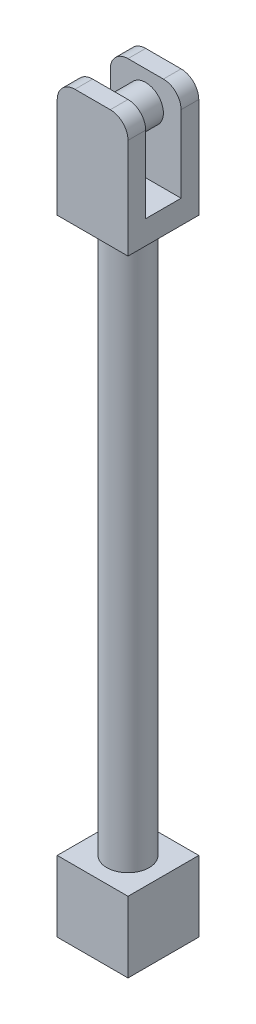
ISO-10303-21;
HEADER;
FILE_DESCRIPTION(('STEP AP214'),'2;1');
FILE_NAME('part.step','',(''),(''),'','','');
FILE_SCHEMA(('AUTOMOTIVE_DESIGN { 1 0 10303 214 1 1 1 1 }'));
ENDSEC;
DATA;
#1=APPLICATION_CONTEXT('core data for automotive mechanical design processes');
#2=APPLICATION_PROTOCOL_DEFINITION('international standard','automotive_design',2000,#1);
#3=PRODUCT_CONTEXT('',#1,'mechanical');
#4=PRODUCT('Part','Part','',(#3));
#5=PRODUCT_RELATED_PRODUCT_CATEGORY('part','',(#4));
#6=PRODUCT_DEFINITION_FORMATION('','',#4);
#7=PRODUCT_DEFINITION_CONTEXT('part definition',#1,'design');
#8=PRODUCT_DEFINITION('design','',#6,#7);
#9=PRODUCT_DEFINITION_SHAPE('','',#8);
#10=(LENGTH_UNIT() NAMED_UNIT(*) SI_UNIT(.MILLI.,.METRE.));
#11=(NAMED_UNIT(*) PLANE_ANGLE_UNIT() SI_UNIT($,.RADIAN.));
#12=(NAMED_UNIT(*) SI_UNIT($,.STERADIAN.) SOLID_ANGLE_UNIT());
#13=UNCERTAINTY_MEASURE_WITH_UNIT(LENGTH_MEASURE(1.E-05),#10,'distance_accuracy_value','');
#14=(GEOMETRIC_REPRESENTATION_CONTEXT(3) GLOBAL_UNCERTAINTY_ASSIGNED_CONTEXT((#13)) GLOBAL_UNIT_ASSIGNED_CONTEXT((#10,
#11,#12)) REPRESENTATION_CONTEXT('',''));
#15=CARTESIAN_POINT('',(0.,0.,0.));
#16=DIRECTION('',(0.,0.,1.));
#17=DIRECTION('',(1.,0.,0.));
#18=AXIS2_PLACEMENT_3D('',#15,#16,#17);
#19=CARTESIAN_POINT('',(0.,315.,0.));
#20=DIRECTION('',(0.,1.,0.));
#21=DIRECTION('',(0.,0.,1.));
#22=AXIS2_PLACEMENT_3D('',#19,#20,#21);
#23=PLANE('',#22);
#24=DIRECTION('',(-1.,0.,0.));
#25=VECTOR('',#24,1.);
#26=CARTESIAN_POINT('',(-15.,315.,-7.5));
#27=LINE('',#26,#25);
#28=CARTESIAN_POINT('',(7.5,315.,-7.5));
#29=VERTEX_POINT('',#28);
#30=CARTESIAN_POINT('',(-7.5,315.,-7.5));
#31=VERTEX_POINT('',#30);
#32=EDGE_CURVE('E172',#29,#31,#27,.T.);
#33=ORIENTED_EDGE('',*,*,#32,.F.);
#34=DIRECTION('',(0.,0.,-1.));
#35=VECTOR('',#34,1.);
#36=CARTESIAN_POINT('',(7.5,315.,-15.));
#37=LINE('',#36,#35);
#38=CARTESIAN_POINT('',(7.5,315.,-15.));
#39=VERTEX_POINT('',#38);
#40=EDGE_CURVE('E283',#29,#39,#37,.T.);
#41=ORIENTED_EDGE('',*,*,#40,.T.);
#42=DIRECTION('',(-1.,0.,0.));
#43=VECTOR('',#42,1.);
#44=CARTESIAN_POINT('',(-15.,315.,-15.));
#45=LINE('',#44,#43);
#46=CARTESIAN_POINT('',(-7.5,315.,-15.));
#47=VERTEX_POINT('',#46);
#48=EDGE_CURVE('E184',#39,#47,#45,.T.);
#49=ORIENTED_EDGE('',*,*,#48,.T.);
#50=DIRECTION('',(0.,0.,1.));
#51=VECTOR('',#50,1.);
#52=CARTESIAN_POINT('',(-7.5,315.,-7.5));
#53=LINE('',#52,#51);
#54=EDGE_CURVE('E279',#47,#31,#53,.T.);
#55=ORIENTED_EDGE('',*,*,#54,.T.);
#56=EDGE_LOOP('',(#33,#41,#49,#55));
#57=FACE_BOUND('',#56,.T.);
#58=ADVANCED_FACE('F39',(#57),#23,.T.);
#59=CARTESIAN_POINT('',(15.,30.,-15.));
#60=DIRECTION('',(-1.,0.,0.));
#61=DIRECTION('',(0.,0.,1.));
#62=AXIS2_PLACEMENT_3D('',#59,#60,#61);
#63=PLANE('',#62);
#64=DIRECTION('',(0.,0.,-1.));
#65=VECTOR('',#64,1.);
#66=CARTESIAN_POINT('',(15.,0.,-15.));
#67=LINE('',#66,#65);
#68=CARTESIAN_POINT('',(15.,0.,15.));
#69=VERTEX_POINT('',#68);
#70=CARTESIAN_POINT('',(15.,0.,-15.));
#71=VERTEX_POINT('',#70);
#72=EDGE_CURVE('E225',#69,#71,#67,.T.);
#73=ORIENTED_EDGE('',*,*,#72,.T.);
#74=DIRECTION('',(0.,-1.,0.));
#75=VECTOR('',#74,1.);
#76=CARTESIAN_POINT('',(15.,30.,-15.));
#77=LINE('',#76,#75);
#78=CARTESIAN_POINT('',(15.,30.,-15.));
#79=VERTEX_POINT('',#78);
#80=EDGE_CURVE('E231',#79,#71,#77,.T.);
#81=ORIENTED_EDGE('',*,*,#80,.F.);
#82=DIRECTION('',(0.,0.,-1.));
#83=VECTOR('',#82,1.);
#84=CARTESIAN_POINT('',(15.,30.,-15.));
#85=LINE('',#84,#83);
#86=CARTESIAN_POINT('',(15.,30.,15.));
#87=VERTEX_POINT('',#86);
#88=EDGE_CURVE('E232',#87,#79,#85,.T.);
#89=ORIENTED_EDGE('',*,*,#88,.F.);
#90=DIRECTION('',(0.,-1.,0.));
#91=VECTOR('',#90,1.);
#92=CARTESIAN_POINT('',(15.,30.,15.));
#93=LINE('',#92,#91);
#94=EDGE_CURVE('E246',#87,#69,#93,.T.);
#95=ORIENTED_EDGE('',*,*,#94,.T.);
#96=EDGE_LOOP('',(#73,#81,#89,#95));
#97=FACE_BOUND('',#96,.T.);
#98=ADVANCED_FACE('F386',(#97),#63,.F.);
#99=CARTESIAN_POINT('',(-15.,30.,-15.));
#100=DIRECTION('',(0.,0.,1.));
#101=DIRECTION('',(1.,0.,0.));
#102=AXIS2_PLACEMENT_3D('',#99,#100,#101);
#103=PLANE('',#102);
#104=DIRECTION('',(-1.,0.,0.));
#105=VECTOR('',#104,1.);
#106=CARTESIAN_POINT('',(-15.,0.,-15.));
#107=LINE('',#106,#105);
#108=CARTESIAN_POINT('',(-15.,0.,-15.));
#109=VERTEX_POINT('',#108);
#110=EDGE_CURVE('E250',#71,#109,#107,.T.);
#111=ORIENTED_EDGE('',*,*,#110,.T.);
#112=DIRECTION('',(0.,-1.,0.));
#113=VECTOR('',#112,1.);
#114=CARTESIAN_POINT('',(-15.,30.,-15.));
#115=LINE('',#114,#113);
#116=CARTESIAN_POINT('',(-15.,30.,-15.));
#117=VERTEX_POINT('',#116);
#118=EDGE_CURVE('E265',#117,#109,#115,.T.);
#119=ORIENTED_EDGE('',*,*,#118,.F.);
#120=DIRECTION('',(-1.,0.,0.));
#121=VECTOR('',#120,1.);
#122=CARTESIAN_POINT('',(-15.,30.,-15.));
#123=LINE('',#122,#121);
#124=EDGE_CURVE('E236',#79,#117,#123,.T.);
#125=ORIENTED_EDGE('',*,*,#124,.F.);
#126=ORIENTED_EDGE('',*,*,#80,.T.);
#127=EDGE_LOOP('',(#111,#119,#125,#126));
#128=FACE_BOUND('',#127,.T.);
#129=ADVANCED_FACE('F390',(#128),#103,.F.);
#130=CARTESIAN_POINT('',(-15.,30.,-15.));
#131=DIRECTION('',(1.,0.,0.));
#132=DIRECTION('',(0.,0.,-1.));
#133=AXIS2_PLACEMENT_3D('',#130,#131,#132);
#134=PLANE('',#133);
#135=DIRECTION('',(0.,0.,1.));
#136=VECTOR('',#135,1.);
#137=CARTESIAN_POINT('',(-15.,0.,-15.));
#138=LINE('',#137,#136);
#139=CARTESIAN_POINT('',(-15.,0.,15.));
#140=VERTEX_POINT('',#139);
#141=EDGE_CURVE('E253',#109,#140,#138,.T.);
#142=ORIENTED_EDGE('',*,*,#141,.T.);
#143=DIRECTION('',(0.,-1.,0.));
#144=VECTOR('',#143,1.);
#145=CARTESIAN_POINT('',(-15.,30.,15.));
#146=LINE('',#145,#144);
#147=CARTESIAN_POINT('',(-15.,30.,15.));
#148=VERTEX_POINT('',#147);
#149=EDGE_CURVE('E261',#148,#140,#146,.T.);
#150=ORIENTED_EDGE('',*,*,#149,.F.);
#151=DIRECTION('',(0.,0.,1.));
#152=VECTOR('',#151,1.);
#153=CARTESIAN_POINT('',(-15.,30.,-15.));
#154=LINE('',#153,#152);
#155=EDGE_CURVE('E240',#117,#148,#154,.T.);
#156=ORIENTED_EDGE('',*,*,#155,.F.);
#157=ORIENTED_EDGE('',*,*,#118,.T.);
#158=EDGE_LOOP('',(#142,#150,#156,#157));
#159=FACE_BOUND('',#158,.T.);
#160=ADVANCED_FACE('F426',(#159),#134,.F.);
#161=CARTESIAN_POINT('',(-15.,30.,15.));
#162=DIRECTION('',(0.,0.,-1.));
#163=DIRECTION('',(-1.,0.,0.));
#164=AXIS2_PLACEMENT_3D('',#161,#162,#163);
#165=PLANE('',#164);
#166=DIRECTION('',(1.,0.,0.));
#167=VECTOR('',#166,1.);
#168=CARTESIAN_POINT('',(-15.,0.,15.));
#169=LINE('',#168,#167);
#170=EDGE_CURVE('E237',#140,#69,#169,.T.);
#171=ORIENTED_EDGE('',*,*,#170,.T.);
#172=ORIENTED_EDGE('',*,*,#94,.F.);
#173=DIRECTION('',(1.,0.,0.));
#174=VECTOR('',#173,1.);
#175=CARTESIAN_POINT('',(-15.,30.,15.));
#176=LINE('',#175,#174);
#177=EDGE_CURVE('E243',#148,#87,#176,.T.);
#178=ORIENTED_EDGE('',*,*,#177,.F.);
#179=ORIENTED_EDGE('',*,*,#149,.T.);
#180=EDGE_LOOP('',(#171,#172,#178,#179));
#181=FACE_BOUND('',#180,.T.);
#182=ADVANCED_FACE('F413',(#181),#165,.F.);
#183=CARTESIAN_POINT('',(0.,30.,0.));
#184=DIRECTION('',(0.,1.,0.));
#185=DIRECTION('',(0.,0.,1.));
#186=AXIS2_PLACEMENT_3D('',#183,#184,#185);
#187=PLANE('',#186);
#188=CARTESIAN_POINT('',(0.,30.,0.));
#189=DIRECTION('',(0.,1.,0.));
#190=DIRECTION('',(0.,0.,1.));
#191=AXIS2_PLACEMENT_3D('',#188,#189,#190);
#192=CIRCLE('',#191,9.);
#193=CARTESIAN_POINT('',(0.,30.,9.));
#194=VERTEX_POINT('',#193);
#195=EDGE_CURVE('E226',#194,#194,#192,.T.);
#196=ORIENTED_EDGE('',*,*,#195,.F.);
#197=EDGE_LOOP('',(#196));
#198=FACE_BOUND('',#197,.T.);
#199=ORIENTED_EDGE('',*,*,#88,.T.);
#200=ORIENTED_EDGE('',*,*,#124,.T.);
#201=ORIENTED_EDGE('',*,*,#155,.T.);
#202=ORIENTED_EDGE('',*,*,#177,.T.);
#203=EDGE_LOOP('',(#199,#200,#201,#202));
#204=FACE_BOUND('',#203,.T.);
#205=ADVANCED_FACE('F410',(#198,#204),#187,.T.);
#206=CARTESIAN_POINT('',(0.,0.,0.));
#207=DIRECTION('',(0.,1.,0.));
#208=DIRECTION('',(0.,0.,1.));
#209=AXIS2_PLACEMENT_3D('',#206,#207,#208);
#210=PLANE('',#209);
#211=ORIENTED_EDGE('',*,*,#72,.F.);
#212=ORIENTED_EDGE('',*,*,#170,.F.);
#213=ORIENTED_EDGE('',*,*,#141,.F.);
#214=ORIENTED_EDGE('',*,*,#110,.F.);
#215=EDGE_LOOP('',(#211,#212,#213,#214));
#216=FACE_BOUND('',#215,.T.);
#217=ADVANCED_FACE('F406',(#216),#210,.F.);
#218=CARTESIAN_POINT('',(0.,265.,0.));
#219=DIRECTION('',(0.,-1.,0.));
#220=DIRECTION('',(0.,0.,-1.));
#221=AXIS2_PLACEMENT_3D('',#218,#219,#220);
#222=CYLINDRICAL_SURFACE('',#221,9.);
#223=CARTESIAN_POINT('',(0.,265.,0.));
#224=DIRECTION('',(0.,1.,0.));
#225=DIRECTION('',(0.,0.,1.));
#226=AXIS2_PLACEMENT_3D('',#223,#224,#225);
#227=CIRCLE('',#226,9.);
#228=CARTESIAN_POINT('',(0.,265.,9.));
#229=VERTEX_POINT('',#228);
#230=EDGE_CURVE('E221',#229,#229,#227,.T.);
#231=ORIENTED_EDGE('',*,*,#230,.F.);
#232=EDGE_LOOP('',(#231));
#233=FACE_BOUND('',#232,.T.);
#234=ORIENTED_EDGE('',*,*,#195,.T.);
#235=EDGE_LOOP('',(#234));
#236=FACE_BOUND('',#235,.T.);
#237=ADVANCED_FACE('F403',(#233,#236),#222,.T.);
#238=CARTESIAN_POINT('',(15.,315.,-15.));
#239=DIRECTION('',(-1.,0.,0.));
#240=DIRECTION('',(0.,0.,1.));
#241=AXIS2_PLACEMENT_3D('',#238,#239,#240);
#242=PLANE('',#241);
#243=DIRECTION('',(0.,-1.,0.));
#244=VECTOR('',#243,1.);
#245=CARTESIAN_POINT('',(15.,315.,-15.));
#246=LINE('',#245,#244);
#247=CARTESIAN_POINT('',(15.,307.5,-15.));
#248=VERTEX_POINT('',#247);
#249=CARTESIAN_POINT('',(15.,265.,-15.));
#250=VERTEX_POINT('',#249);
#251=EDGE_CURVE('E218',#248,#250,#246,.T.);
#252=ORIENTED_EDGE('',*,*,#251,.F.);
#253=DIRECTION('',(0.,0.,-1.));
#254=VECTOR('',#253,1.);
#255=CARTESIAN_POINT('',(15.,307.5,-7.5));
#256=LINE('',#255,#254);
#257=CARTESIAN_POINT('',(15.,307.5,-7.5));
#258=VERTEX_POINT('',#257);
#259=EDGE_CURVE('E296',#248,#258,#256,.F.);
#260=ORIENTED_EDGE('',*,*,#259,.T.);
#261=DIRECTION('',(0.,1.,0.));
#262=VECTOR('',#261,1.);
#263=CARTESIAN_POINT('',(15.,275.,-7.5));
#264=LINE('',#263,#262);
#265=CARTESIAN_POINT('',(15.,275.,-7.5));
#266=VERTEX_POINT('',#265);
#267=EDGE_CURVE('E179',#266,#258,#264,.T.);
#268=ORIENTED_EDGE('',*,*,#267,.F.);
#269=DIRECTION('',(0.,0.,-1.));
#270=VECTOR('',#269,1.);
#271=CARTESIAN_POINT('',(15.,275.,-7.5));
#272=LINE('',#271,#270);
#273=CARTESIAN_POINT('',(15.,275.,7.5));
#274=VERTEX_POINT('',#273);
#275=EDGE_CURVE('E162',#274,#266,#272,.T.);
#276=ORIENTED_EDGE('',*,*,#275,.F.);
#277=DIRECTION('',(0.,1.,0.));
#278=VECTOR('',#277,1.);
#279=CARTESIAN_POINT('',(15.,275.,7.5));
#280=LINE('',#279,#278);
#281=CARTESIAN_POINT('',(15.,307.5,7.5));
#282=VERTEX_POINT('',#281);
#283=EDGE_CURVE('E158',#274,#282,#280,.T.);
#284=ORIENTED_EDGE('',*,*,#283,.T.);
#285=DIRECTION('',(0.,0.,-1.));
#286=VECTOR('',#285,1.);
#287=CARTESIAN_POINT('',(15.,307.5,15.));
#288=LINE('',#287,#286);
#289=CARTESIAN_POINT('',(15.,307.5,15.));
#290=VERTEX_POINT('',#289);
#291=EDGE_CURVE('E293',#282,#290,#288,.F.);
#292=ORIENTED_EDGE('',*,*,#291,.T.);
#293=DIRECTION('',(0.,-1.,0.));
#294=VECTOR('',#293,1.);
#295=CARTESIAN_POINT('',(15.,315.,15.));
#296=LINE('',#295,#294);
#297=CARTESIAN_POINT('',(15.,265.,15.));
#298=VERTEX_POINT('',#297);
#299=EDGE_CURVE('E193',#290,#298,#296,.T.);
#300=ORIENTED_EDGE('',*,*,#299,.T.);
#301=DIRECTION('',(0.,0.,-1.));
#302=VECTOR('',#301,1.);
#303=CARTESIAN_POINT('',(15.,265.,-15.));
#304=LINE('',#303,#302);
#305=EDGE_CURVE('E194',#298,#250,#304,.T.);
#306=ORIENTED_EDGE('',*,*,#305,.T.);
#307=EDGE_LOOP('',(#252,#260,#268,#276,#284,#292,#300,#306));
#308=FACE_BOUND('',#307,.T.);
#309=ADVANCED_FACE('F356',(#308),#242,.F.);
#310=CARTESIAN_POINT('',(-15.,315.,-15.));
#311=DIRECTION('',(0.,0.,1.));
#312=DIRECTION('',(1.,0.,0.));
#313=AXIS2_PLACEMENT_3D('',#310,#311,#312);
#314=PLANE('',#313);
#315=ORIENTED_EDGE('',*,*,#48,.F.);
#316=CARTESIAN_POINT('',(7.5,307.5,-15.));
#317=DIRECTION('',(0.,0.,1.));
#318=DIRECTION('',(1.,0.,0.));
#319=AXIS2_PLACEMENT_3D('',#316,#317,#318);
#320=CIRCLE('',#319,7.5);
#321=EDGE_CURVE('E290',#39,#248,#320,.F.);
#322=ORIENTED_EDGE('',*,*,#321,.T.);
#323=ORIENTED_EDGE('',*,*,#251,.T.);
#324=DIRECTION('',(-1.,0.,0.));
#325=VECTOR('',#324,1.);
#326=CARTESIAN_POINT('',(-15.,265.,-15.));
#327=LINE('',#326,#325);
#328=CARTESIAN_POINT('',(-15.,265.,-15.));
#329=VERTEX_POINT('',#328);
#330=EDGE_CURVE('E198',#250,#329,#327,.T.);
#331=ORIENTED_EDGE('',*,*,#330,.T.);
#332=DIRECTION('',(0.,-1.,0.));
#333=VECTOR('',#332,1.);
#334=CARTESIAN_POINT('',(-15.,315.,-15.));
#335=LINE('',#334,#333);
#336=CARTESIAN_POINT('',(-15.,307.5,-15.));
#337=VERTEX_POINT('',#336);
#338=EDGE_CURVE('E215',#337,#329,#335,.T.);
#339=ORIENTED_EDGE('',*,*,#338,.F.);
#340=CARTESIAN_POINT('',(-7.5,307.5,-15.));
#341=DIRECTION('',(0.,0.,1.));
#342=DIRECTION('',(1.,0.,0.));
#343=AXIS2_PLACEMENT_3D('',#340,#341,#342);
#344=CIRCLE('',#343,7.5);
#345=EDGE_CURVE('E287',#337,#47,#344,.F.);
#346=ORIENTED_EDGE('',*,*,#345,.T.);
#347=EDGE_LOOP('',(#315,#322,#323,#331,#339,#346));
#348=FACE_BOUND('',#347,.T.);
#349=ADVANCED_FACE('F330',(#348),#314,.F.);
#350=CARTESIAN_POINT('',(-15.,315.,-15.));
#351=DIRECTION('',(1.,0.,0.));
#352=DIRECTION('',(0.,0.,-1.));
#353=AXIS2_PLACEMENT_3D('',#350,#351,#352);
#354=PLANE('',#353);
#355=DIRECTION('',(0.,-1.,0.));
#356=VECTOR('',#355,1.);
#357=CARTESIAN_POINT('',(-15.,315.,15.));
#358=LINE('',#357,#356);
#359=CARTESIAN_POINT('',(-15.,307.5,15.));
#360=VERTEX_POINT('',#359);
#361=CARTESIAN_POINT('',(-15.,265.,15.));
#362=VERTEX_POINT('',#361);
#363=EDGE_CURVE('E212',#360,#362,#358,.T.);
#364=ORIENTED_EDGE('',*,*,#363,.F.);
#365=DIRECTION('',(0.,0.,1.));
#366=VECTOR('',#365,1.);
#367=CARTESIAN_POINT('',(-15.,307.5,7.5));
#368=LINE('',#367,#366);
#369=CARTESIAN_POINT('',(-15.,307.5,7.5));
#370=VERTEX_POINT('',#369);
#371=EDGE_CURVE('E11',#360,#370,#368,.F.);
#372=ORIENTED_EDGE('',*,*,#371,.T.);
#373=DIRECTION('',(0.,1.,0.));
#374=VECTOR('',#373,1.);
#375=CARTESIAN_POINT('',(-15.,275.,7.5));
#376=LINE('',#375,#374);
#377=CARTESIAN_POINT('',(-15.,275.,7.5));
#378=VERTEX_POINT('',#377);
#379=EDGE_CURVE('E155',#378,#370,#376,.T.);
#380=ORIENTED_EDGE('',*,*,#379,.F.);
#381=DIRECTION('',(0.,0.,1.));
#382=VECTOR('',#381,1.);
#383=CARTESIAN_POINT('',(-15.,275.,-7.5));
#384=LINE('',#383,#382);
#385=CARTESIAN_POINT('',(-15.,275.,-7.5));
#386=VERTEX_POINT('',#385);
#387=EDGE_CURVE('E163',#386,#378,#384,.T.);
#388=ORIENTED_EDGE('',*,*,#387,.F.);
#389=DIRECTION('',(0.,1.,0.));
#390=VECTOR('',#389,1.);
#391=CARTESIAN_POINT('',(-15.,275.,-7.5));
#392=LINE('',#391,#390);
#393=CARTESIAN_POINT('',(-15.,307.5,-7.5));
#394=VERTEX_POINT('',#393);
#395=EDGE_CURVE('E199',#386,#394,#392,.T.);
#396=ORIENTED_EDGE('',*,*,#395,.T.);
#397=DIRECTION('',(0.,0.,1.));
#398=VECTOR('',#397,1.);
#399=CARTESIAN_POINT('',(-15.,307.5,-15.));
#400=LINE('',#399,#398);
#401=EDGE_CURVE('E48',#394,#337,#400,.F.);
#402=ORIENTED_EDGE('',*,*,#401,.T.);
#403=ORIENTED_EDGE('',*,*,#338,.T.);
#404=DIRECTION('',(0.,0.,1.));
#405=VECTOR('',#404,1.);
#406=CARTESIAN_POINT('',(-15.,265.,-15.));
#407=LINE('',#406,#405);
#408=EDGE_CURVE('E203',#329,#362,#407,.T.);
#409=ORIENTED_EDGE('',*,*,#408,.T.);
#410=EDGE_LOOP('',(#364,#372,#380,#388,#396,#402,#403,#409));
#411=FACE_BOUND('',#410,.T.);
#412=ADVANCED_FACE('F174',(#411),#354,.F.);
#413=CARTESIAN_POINT('',(-15.,315.,15.));
#414=DIRECTION('',(0.,0.,-1.));
#415=DIRECTION('',(-1.,0.,0.));
#416=AXIS2_PLACEMENT_3D('',#413,#414,#415);
#417=PLANE('',#416);
#418=ORIENTED_EDGE('',*,*,#299,.F.);
#419=CARTESIAN_POINT('',(7.5,307.5,15.));
#420=DIRECTION('',(0.,0.,-1.));
#421=DIRECTION('',(-1.,0.,0.));
#422=AXIS2_PLACEMENT_3D('',#419,#420,#421);
#423=CIRCLE('',#422,7.5);
#424=CARTESIAN_POINT('',(7.5,315.,15.));
#425=VERTEX_POINT('',#424);
#426=EDGE_CURVE('E321',#290,#425,#423,.F.);
#427=ORIENTED_EDGE('',*,*,#426,.T.);
#428=DIRECTION('',(1.,0.,0.));
#429=VECTOR('',#428,1.);
#430=CARTESIAN_POINT('',(-15.,315.,15.));
#431=LINE('',#430,#429);
#432=CARTESIAN_POINT('',(-7.5,315.,15.));
#433=VERTEX_POINT('',#432);
#434=EDGE_CURVE('E188',#433,#425,#431,.T.);
#435=ORIENTED_EDGE('',*,*,#434,.F.);
#436=CARTESIAN_POINT('',(-7.5,307.5,15.));
#437=DIRECTION('',(0.,0.,-1.));
#438=DIRECTION('',(-1.,0.,0.));
#439=AXIS2_PLACEMENT_3D('',#436,#437,#438);
#440=CIRCLE('',#439,7.5);
#441=EDGE_CURVE('E55',#433,#360,#440,.F.);
#442=ORIENTED_EDGE('',*,*,#441,.T.);
#443=ORIENTED_EDGE('',*,*,#363,.T.);
#444=DIRECTION('',(1.,0.,0.));
#445=VECTOR('',#444,1.);
#446=CARTESIAN_POINT('',(-15.,265.,15.));
#447=LINE('',#446,#445);
#448=EDGE_CURVE('E189',#362,#298,#447,.T.);
#449=ORIENTED_EDGE('',*,*,#448,.T.);
#450=EDGE_LOOP('',(#418,#427,#435,#442,#443,#449));
#451=FACE_BOUND('',#450,.T.);
#452=ADVANCED_FACE('F375',(#451),#417,.F.);
#453=ORIENTED_EDGE('',*,*,#434,.T.);
#454=DIRECTION('',(0.,0.,-1.));
#455=VECTOR('',#454,1.);
#456=CARTESIAN_POINT('',(7.5,315.,7.5));
#457=LINE('',#456,#455);
#458=CARTESIAN_POINT('',(7.5,315.,7.5));
#459=VERTEX_POINT('',#458);
#460=EDGE_CURVE('E309',#425,#459,#457,.T.);
#461=ORIENTED_EDGE('',*,*,#460,.T.);
#462=DIRECTION('',(1.,0.,0.));
#463=VECTOR('',#462,1.);
#464=CARTESIAN_POINT('',(-15.,315.,7.5));
#465=LINE('',#464,#463);
#466=CARTESIAN_POINT('',(-7.5,315.,7.5));
#467=VERTEX_POINT('',#466);
#468=EDGE_CURVE('E343',#467,#459,#465,.T.);
#469=ORIENTED_EDGE('',*,*,#468,.F.);
#470=DIRECTION('',(0.,0.,1.));
#471=VECTOR('',#470,1.);
#472=CARTESIAN_POINT('',(-7.5,315.,15.));
#473=LINE('',#472,#471);
#474=EDGE_CURVE('E305',#467,#433,#473,.T.);
#475=ORIENTED_EDGE('',*,*,#474,.T.);
#476=EDGE_LOOP('',(#453,#461,#469,#475));
#477=FACE_BOUND('',#476,.T.);
#478=ADVANCED_FACE('F367',(#477),#23,.T.);
#479=CARTESIAN_POINT('',(0.,265.,0.));
#480=DIRECTION('',(0.,1.,0.));
#481=DIRECTION('',(0.,0.,1.));
#482=AXIS2_PLACEMENT_3D('',#479,#480,#481);
#483=PLANE('',#482);
#484=ORIENTED_EDGE('',*,*,#230,.T.);
#485=EDGE_LOOP('',(#484));
#486=FACE_BOUND('',#485,.T.);
#487=ORIENTED_EDGE('',*,*,#305,.F.);
#488=ORIENTED_EDGE('',*,*,#448,.F.);
#489=ORIENTED_EDGE('',*,*,#408,.F.);
#490=ORIENTED_EDGE('',*,*,#330,.F.);
#491=EDGE_LOOP('',(#487,#488,#489,#490));
#492=FACE_BOUND('',#491,.T.);
#493=ADVANCED_FACE('F361',(#486,#492),#483,.F.);
#494=CARTESIAN_POINT('',(-15.,275.,-7.5));
#495=DIRECTION('',(0.,0.,-1.));
#496=DIRECTION('',(-1.,0.,0.));
#497=AXIS2_PLACEMENT_3D('',#494,#495,#496);
#498=PLANE('',#497);
#499=CARTESIAN_POINT('',(0.,302.5,-7.5));
#500=DIRECTION('',(0.,0.,-1.));
#501=DIRECTION('',(-1.,0.,0.));
#502=AXIS2_PLACEMENT_3D('',#499,#500,#501);
#503=CIRCLE('',#502,7.50000000000001);
#504=CARTESIAN_POINT('',(-7.50000000000001,302.5,-7.5));
#505=VERTEX_POINT('',#504);
#506=EDGE_CURVE('E275',#505,#505,#503,.F.);
#507=ORIENTED_EDGE('',*,*,#506,.F.);
#508=EDGE_LOOP('',(#507));
#509=FACE_BOUND('',#508,.T.);
#510=ORIENTED_EDGE('',*,*,#267,.T.);
#511=CARTESIAN_POINT('',(7.5,307.5,-7.5));
#512=DIRECTION('',(0.,0.,-1.));
#513=DIRECTION('',(-1.,0.,0.));
#514=AXIS2_PLACEMENT_3D('',#511,#512,#513);
#515=CIRCLE('',#514,7.5);
#516=EDGE_CURVE('E302',#258,#29,#515,.F.);
#517=ORIENTED_EDGE('',*,*,#516,.T.);
#518=ORIENTED_EDGE('',*,*,#32,.T.);
#519=CARTESIAN_POINT('',(-7.5,307.5,-7.5));
#520=DIRECTION('',(0.,0.,-1.));
#521=DIRECTION('',(-1.,0.,0.));
#522=AXIS2_PLACEMENT_3D('',#519,#520,#521);
#523=CIRCLE('',#522,7.5);
#524=EDGE_CURVE('E299',#31,#394,#523,.F.);
#525=ORIENTED_EDGE('',*,*,#524,.T.);
#526=ORIENTED_EDGE('',*,*,#395,.F.);
#527=DIRECTION('',(-1.,0.,0.));
#528=VECTOR('',#527,1.);
#529=CARTESIAN_POINT('',(-15.,275.,-7.5));
#530=LINE('',#529,#528);
#531=EDGE_CURVE('E169',#266,#386,#530,.T.);
#532=ORIENTED_EDGE('',*,*,#531,.F.);
#533=EDGE_LOOP('',(#510,#517,#518,#525,#526,#532));
#534=FACE_BOUND('',#533,.T.);
#535=ADVANCED_FACE('F340',(#509,#534),#498,.F.);
#536=CARTESIAN_POINT('',(-15.,275.,7.5));
#537=DIRECTION('',(0.,0.,1.));
#538=DIRECTION('',(1.,0.,0.));
#539=AXIS2_PLACEMENT_3D('',#536,#537,#538);
#540=PLANE('',#539);
#541=CARTESIAN_POINT('',(0.,302.5,7.5));
#542=DIRECTION('',(0.,0.,1.));
#543=DIRECTION('',(1.,0.,0.));
#544=AXIS2_PLACEMENT_3D('',#541,#542,#543);
#545=CIRCLE('',#544,7.50000000000001);
#546=CARTESIAN_POINT('',(7.50000000000001,302.5,7.5));
#547=VERTEX_POINT('',#546);
#548=EDGE_CURVE('E230',#547,#547,#545,.F.);
#549=ORIENTED_EDGE('',*,*,#548,.F.);
#550=EDGE_LOOP('',(#549));
#551=FACE_BOUND('',#550,.T.);
#552=ORIENTED_EDGE('',*,*,#468,.T.);
#553=CARTESIAN_POINT('',(7.5,307.5,7.5));
#554=DIRECTION('',(0.,0.,1.));
#555=DIRECTION('',(1.,0.,0.));
#556=AXIS2_PLACEMENT_3D('',#553,#554,#555);
#557=CIRCLE('',#556,7.5);
#558=EDGE_CURVE('E316',#459,#282,#557,.F.);
#559=ORIENTED_EDGE('',*,*,#558,.T.);
#560=ORIENTED_EDGE('',*,*,#283,.F.);
#561=DIRECTION('',(1.,0.,0.));
#562=VECTOR('',#561,1.);
#563=CARTESIAN_POINT('',(-15.,275.,7.5));
#564=LINE('',#563,#562);
#565=EDGE_CURVE('E151',#378,#274,#564,.T.);
#566=ORIENTED_EDGE('',*,*,#565,.F.);
#567=ORIENTED_EDGE('',*,*,#379,.T.);
#568=CARTESIAN_POINT('',(-7.5,307.5,7.5));
#569=DIRECTION('',(0.,0.,1.));
#570=DIRECTION('',(1.,0.,0.));
#571=AXIS2_PLACEMENT_3D('',#568,#569,#570);
#572=CIRCLE('',#571,7.5);
#573=EDGE_CURVE('E313',#370,#467,#572,.F.);
#574=ORIENTED_EDGE('',*,*,#573,.T.);
#575=EDGE_LOOP('',(#552,#559,#560,#566,#567,#574));
#576=FACE_BOUND('',#575,.T.);
#577=ADVANCED_FACE('F154',(#551,#576),#540,.F.);
#578=CARTESIAN_POINT('',(0.,275.,0.));
#579=DIRECTION('',(0.,1.,0.));
#580=DIRECTION('',(0.,0.,1.));
#581=AXIS2_PLACEMENT_3D('',#578,#579,#580);
#582=PLANE('',#581);
#583=ORIENTED_EDGE('',*,*,#387,.T.);
#584=ORIENTED_EDGE('',*,*,#565,.T.);
#585=ORIENTED_EDGE('',*,*,#275,.T.);
#586=ORIENTED_EDGE('',*,*,#531,.T.);
#587=EDGE_LOOP('',(#583,#584,#585,#586));
#588=FACE_BOUND('',#587,.T.);
#589=ADVANCED_FACE('F167',(#588),#582,.T.);
#590=CARTESIAN_POINT('',(0.,302.5,-28.7132034355965));
#591=DIRECTION('',(0.,0.,1.));
#592=DIRECTION('',(1.,0.,0.));
#593=AXIS2_PLACEMENT_3D('',#590,#591,#592);
#594=CYLINDRICAL_SURFACE('',#593,7.50000000000001);
#595=ORIENTED_EDGE('',*,*,#548,.T.);
#596=EDGE_LOOP('',(#595));
#597=FACE_BOUND('',#596,.T.);
#598=ORIENTED_EDGE('',*,*,#506,.T.);
#599=EDGE_LOOP('',(#598));
#600=FACE_BOUND('',#599,.T.);
#601=ADVANCED_FACE('F443',(#597,#600),#594,.T.);
#602=CARTESIAN_POINT('',(7.5,307.5,0.));
#603=DIRECTION('',(0.,0.,1.));
#604=DIRECTION('',(1.,0.,0.));
#605=AXIS2_PLACEMENT_3D('',#602,#603,#604);
#606=CYLINDRICAL_SURFACE('',#605,7.5);
#607=ORIENTED_EDGE('',*,*,#516,.F.);
#608=ORIENTED_EDGE('',*,*,#259,.F.);
#609=ORIENTED_EDGE('',*,*,#321,.F.);
#610=ORIENTED_EDGE('',*,*,#40,.F.);
#611=EDGE_LOOP('',(#607,#608,#609,#610));
#612=FACE_BOUND('',#611,.T.);
#613=ADVANCED_FACE('F354',(#612),#606,.T.);
#614=CARTESIAN_POINT('',(7.5,307.5,0.));
#615=DIRECTION('',(0.,0.,1.));
#616=DIRECTION('',(1.,0.,0.));
#617=AXIS2_PLACEMENT_3D('',#614,#615,#616);
#618=CYLINDRICAL_SURFACE('',#617,7.5);
#619=ORIENTED_EDGE('',*,*,#426,.F.);
#620=ORIENTED_EDGE('',*,*,#291,.F.);
#621=ORIENTED_EDGE('',*,*,#558,.F.);
#622=ORIENTED_EDGE('',*,*,#460,.F.);
#623=EDGE_LOOP('',(#619,#620,#621,#622));
#624=FACE_BOUND('',#623,.T.);
#625=ADVANCED_FACE('F371',(#624),#618,.T.);
#626=CARTESIAN_POINT('',(-7.5,307.5,0.));
#627=DIRECTION('',(0.,0.,-1.));
#628=DIRECTION('',(-1.,0.,0.));
#629=AXIS2_PLACEMENT_3D('',#626,#627,#628);
#630=CYLINDRICAL_SURFACE('',#629,7.5);
#631=ORIENTED_EDGE('',*,*,#573,.F.);
#632=ORIENTED_EDGE('',*,*,#371,.F.);
#633=ORIENTED_EDGE('',*,*,#441,.F.);
#634=ORIENTED_EDGE('',*,*,#474,.F.);
#635=EDGE_LOOP('',(#631,#632,#633,#634));
#636=FACE_BOUND('',#635,.T.);
#637=ADVANCED_FACE('F363',(#636),#630,.T.);
#638=CARTESIAN_POINT('',(-7.5,307.5,0.));
#639=DIRECTION('',(0.,0.,-1.));
#640=DIRECTION('',(-1.,0.,0.));
#641=AXIS2_PLACEMENT_3D('',#638,#639,#640);
#642=CYLINDRICAL_SURFACE('',#641,7.5);
#643=ORIENTED_EDGE('',*,*,#345,.F.);
#644=ORIENTED_EDGE('',*,*,#401,.F.);
#645=ORIENTED_EDGE('',*,*,#524,.F.);
#646=ORIENTED_EDGE('',*,*,#54,.F.);
#647=EDGE_LOOP('',(#643,#644,#645,#646));
#648=FACE_BOUND('',#647,.T.);
#649=ADVANCED_FACE('F41',(#648),#642,.T.);
#650=CLOSED_SHELL('',(#58,#98,#129,#160,#182,#205,#217,#237,#309,#349,#412,#452,#478,#493,#535,
#577,#589,#601,#613,#625,#637,#649));
#651=MANIFOLD_SOLID_BREP('B2',#650);
#652=ADVANCED_BREP_SHAPE_REPRESENTATION('',(#18,#651),#14);
#653=SHAPE_DEFINITION_REPRESENTATION(#9,#652);
ENDSEC;
END-ISO-10303-21;
